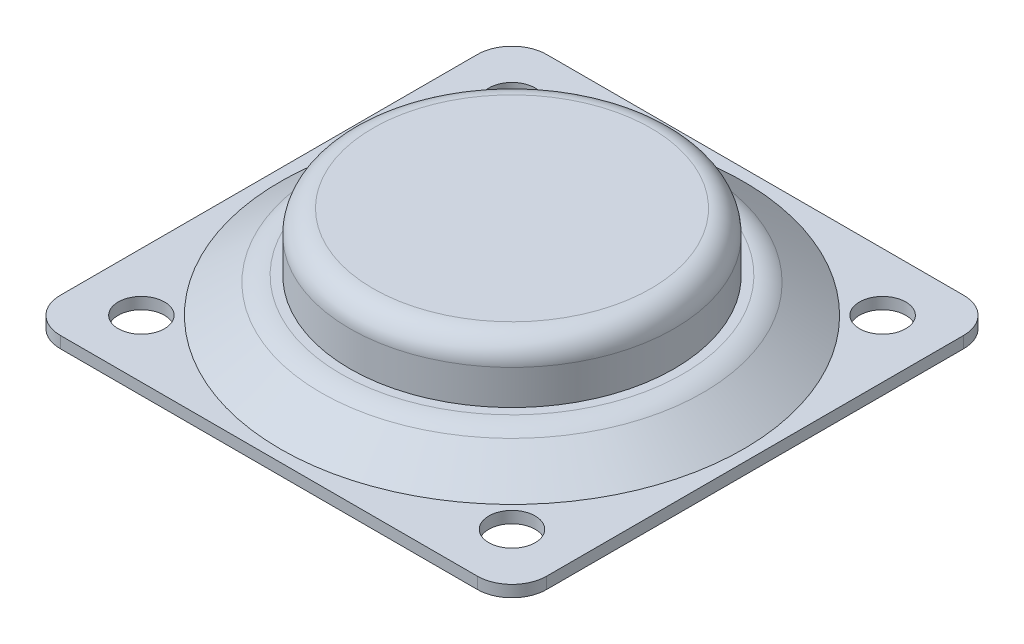
ISO-10303-21;
HEADER;
FILE_DESCRIPTION(('STEP AP214'),'2;1');
FILE_NAME('part.step','',(''),(''),'','','');
FILE_SCHEMA(('AUTOMOTIVE_DESIGN { 1 0 10303 214 1 1 1 1 }'));
ENDSEC;
DATA;
#1=APPLICATION_CONTEXT('core data for automotive mechanical design processes');
#2=APPLICATION_PROTOCOL_DEFINITION('international standard','automotive_design',2000,#1);
#3=PRODUCT_CONTEXT('',#1,'mechanical');
#4=PRODUCT('Part','Part','',(#3));
#5=PRODUCT_RELATED_PRODUCT_CATEGORY('part','',(#4));
#6=PRODUCT_DEFINITION_FORMATION('','',#4);
#7=PRODUCT_DEFINITION_CONTEXT('part definition',#1,'design');
#8=PRODUCT_DEFINITION('design','',#6,#7);
#9=PRODUCT_DEFINITION_SHAPE('','',#8);
#10=(LENGTH_UNIT() NAMED_UNIT(*) SI_UNIT(.MILLI.,.METRE.));
#11=(NAMED_UNIT(*) PLANE_ANGLE_UNIT() SI_UNIT($,.RADIAN.));
#12=(NAMED_UNIT(*) SI_UNIT($,.STERADIAN.) SOLID_ANGLE_UNIT());
#13=UNCERTAINTY_MEASURE_WITH_UNIT(LENGTH_MEASURE(1.E-05),#10,'distance_accuracy_value','');
#14=(GEOMETRIC_REPRESENTATION_CONTEXT(3) GLOBAL_UNCERTAINTY_ASSIGNED_CONTEXT((#13)) GLOBAL_UNIT_ASSIGNED_CONTEXT((#10,
#11,#12)) REPRESENTATION_CONTEXT('',''));
#15=CARTESIAN_POINT('',(0.,0.,0.));
#16=DIRECTION('',(0.,0.,1.));
#17=DIRECTION('',(1.,0.,0.));
#18=AXIS2_PLACEMENT_3D('',#15,#16,#17);
#19=CARTESIAN_POINT('',(-21.,1.,21.));
#20=DIRECTION('',(1.,0.,0.));
#21=DIRECTION('',(0.,0.,-1.));
#22=AXIS2_PLACEMENT_3D('',#19,#20,#21);
#23=PLANE('',#22);
#24=DIRECTION('',(0.,0.,1.));
#25=VECTOR('',#24,1.);
#26=CARTESIAN_POINT('',(-21.,1.,21.));
#27=LINE('',#26,#25);
#28=CARTESIAN_POINT('',(-21.,1.,-18.));
#29=VERTEX_POINT('',#28);
#30=CARTESIAN_POINT('',(-21.,1.,18.));
#31=VERTEX_POINT('',#30);
#32=EDGE_CURVE('E134',#29,#31,#27,.T.);
#33=ORIENTED_EDGE('',*,*,#32,.F.);
#34=DIRECTION('',(0.,-1.,0.));
#35=VECTOR('',#34,1.);
#36=CARTESIAN_POINT('',(-21.,1.,-18.));
#37=LINE('',#36,#35);
#38=CARTESIAN_POINT('',(-21.,0.,-18.));
#39=VERTEX_POINT('',#38);
#40=EDGE_CURVE('E119',#29,#39,#37,.T.);
#41=ORIENTED_EDGE('',*,*,#40,.T.);
#42=DIRECTION('',(0.,0.,1.));
#43=VECTOR('',#42,1.);
#44=CARTESIAN_POINT('',(-21.,0.,21.));
#45=LINE('',#44,#43);
#46=CARTESIAN_POINT('',(-21.,0.,18.));
#47=VERTEX_POINT('',#46);
#48=EDGE_CURVE('E131',#39,#47,#45,.T.);
#49=ORIENTED_EDGE('',*,*,#48,.T.);
#50=DIRECTION('',(0.,-1.,0.));
#51=VECTOR('',#50,1.);
#52=CARTESIAN_POINT('',(-21.,1.,18.));
#53=LINE('',#52,#51);
#54=EDGE_CURVE('E136',#47,#31,#53,.F.);
#55=ORIENTED_EDGE('',*,*,#54,.T.);
#56=EDGE_LOOP('',(#33,#41,#49,#55));
#57=FACE_BOUND('',#56,.T.);
#58=ADVANCED_FACE('F47',(#57),#23,.F.);
#59=CARTESIAN_POINT('',(-21.,1.,21.));
#60=DIRECTION('',(0.,0.,-1.));
#61=DIRECTION('',(-1.,0.,0.));
#62=AXIS2_PLACEMENT_3D('',#59,#60,#61);
#63=PLANE('',#62);
#64=DIRECTION('',(1.,0.,0.));
#65=VECTOR('',#64,1.);
#66=CARTESIAN_POINT('',(-21.,0.,21.));
#67=LINE('',#66,#65);
#68=CARTESIAN_POINT('',(-18.,0.,21.));
#69=VERTEX_POINT('',#68);
#70=CARTESIAN_POINT('',(18.,0.,21.));
#71=VERTEX_POINT('',#70);
#72=EDGE_CURVE('E140',#69,#71,#67,.T.);
#73=ORIENTED_EDGE('',*,*,#72,.T.);
#74=DIRECTION('',(0.,-1.,0.));
#75=VECTOR('',#74,1.);
#76=CARTESIAN_POINT('',(18.,1.,21.));
#77=LINE('',#76,#75);
#78=CARTESIAN_POINT('',(18.,1.,21.));
#79=VERTEX_POINT('',#78);
#80=EDGE_CURVE('E51',#71,#79,#77,.F.);
#81=ORIENTED_EDGE('',*,*,#80,.T.);
#82=DIRECTION('',(1.,0.,0.));
#83=VECTOR('',#82,1.);
#84=CARTESIAN_POINT('',(-21.,1.,21.));
#85=LINE('',#84,#83);
#86=CARTESIAN_POINT('',(-18.,1.,21.));
#87=VERTEX_POINT('',#86);
#88=EDGE_CURVE('E181',#87,#79,#85,.T.);
#89=ORIENTED_EDGE('',*,*,#88,.F.);
#90=DIRECTION('',(0.,-1.,0.));
#91=VECTOR('',#90,1.);
#92=CARTESIAN_POINT('',(-18.,1.,21.));
#93=LINE('',#92,#91);
#94=EDGE_CURVE('E174',#87,#69,#93,.T.);
#95=ORIENTED_EDGE('',*,*,#94,.T.);
#96=EDGE_LOOP('',(#73,#81,#89,#95));
#97=FACE_BOUND('',#96,.T.);
#98=ADVANCED_FACE('F180',(#97),#63,.F.);
#99=CARTESIAN_POINT('',(21.,1.,21.));
#100=DIRECTION('',(-1.,0.,0.));
#101=DIRECTION('',(0.,0.,1.));
#102=AXIS2_PLACEMENT_3D('',#99,#100,#101);
#103=PLANE('',#102);
#104=DIRECTION('',(0.,0.,-1.));
#105=VECTOR('',#104,1.);
#106=CARTESIAN_POINT('',(21.,0.,21.));
#107=LINE('',#106,#105);
#108=CARTESIAN_POINT('',(21.,0.,18.));
#109=VERTEX_POINT('',#108);
#110=CARTESIAN_POINT('',(21.,0.,-18.));
#111=VERTEX_POINT('',#110);
#112=EDGE_CURVE('E144',#109,#111,#107,.T.);
#113=ORIENTED_EDGE('',*,*,#112,.T.);
#114=DIRECTION('',(0.,-1.,0.));
#115=VECTOR('',#114,1.);
#116=CARTESIAN_POINT('',(21.,1.,-18.));
#117=LINE('',#116,#115);
#118=CARTESIAN_POINT('',(21.,1.,-18.));
#119=VERTEX_POINT('',#118);
#120=EDGE_CURVE('E63',#111,#119,#117,.F.);
#121=ORIENTED_EDGE('',*,*,#120,.T.);
#122=DIRECTION('',(0.,0.,-1.));
#123=VECTOR('',#122,1.);
#124=CARTESIAN_POINT('',(21.,1.,21.));
#125=LINE('',#124,#123);
#126=CARTESIAN_POINT('',(21.,1.,18.));
#127=VERTEX_POINT('',#126);
#128=EDGE_CURVE('E186',#127,#119,#125,.T.);
#129=ORIENTED_EDGE('',*,*,#128,.F.);
#130=DIRECTION('',(0.,-1.,0.));
#131=VECTOR('',#130,1.);
#132=CARTESIAN_POINT('',(21.,1.,18.));
#133=LINE('',#132,#131);
#134=EDGE_CURVE('E171',#127,#109,#133,.T.);
#135=ORIENTED_EDGE('',*,*,#134,.T.);
#136=EDGE_LOOP('',(#113,#121,#129,#135));
#137=FACE_BOUND('',#136,.T.);
#138=ADVANCED_FACE('F191',(#137),#103,.F.);
#139=CARTESIAN_POINT('',(-21.,1.,-21.));
#140=DIRECTION('',(0.,0.,1.));
#141=DIRECTION('',(1.,0.,0.));
#142=AXIS2_PLACEMENT_3D('',#139,#140,#141);
#143=PLANE('',#142);
#144=DIRECTION('',(-1.,0.,0.));
#145=VECTOR('',#144,1.);
#146=CARTESIAN_POINT('',(-21.,0.,-21.));
#147=LINE('',#146,#145);
#148=CARTESIAN_POINT('',(18.,0.,-21.));
#149=VERTEX_POINT('',#148);
#150=CARTESIAN_POINT('',(-18.,0.,-21.));
#151=VERTEX_POINT('',#150);
#152=EDGE_CURVE('E154',#149,#151,#147,.T.);
#153=ORIENTED_EDGE('',*,*,#152,.T.);
#154=DIRECTION('',(0.,-1.,0.));
#155=VECTOR('',#154,1.);
#156=CARTESIAN_POINT('',(-18.,1.,-21.));
#157=LINE('',#156,#155);
#158=CARTESIAN_POINT('',(-18.,1.,-21.));
#159=VERTEX_POINT('',#158);
#160=EDGE_CURVE('E120',#151,#159,#157,.F.);
#161=ORIENTED_EDGE('',*,*,#160,.T.);
#162=DIRECTION('',(-1.,0.,0.));
#163=VECTOR('',#162,1.);
#164=CARTESIAN_POINT('',(-21.,1.,-21.));
#165=LINE('',#164,#163);
#166=CARTESIAN_POINT('',(18.,1.,-21.));
#167=VERTEX_POINT('',#166);
#168=EDGE_CURVE('E150',#167,#159,#165,.T.);
#169=ORIENTED_EDGE('',*,*,#168,.F.);
#170=DIRECTION('',(0.,-1.,0.));
#171=VECTOR('',#170,1.);
#172=CARTESIAN_POINT('',(18.,1.,-21.));
#173=LINE('',#172,#171);
#174=EDGE_CURVE('E125',#167,#149,#173,.T.);
#175=ORIENTED_EDGE('',*,*,#174,.T.);
#176=EDGE_LOOP('',(#153,#161,#169,#175));
#177=FACE_BOUND('',#176,.T.);
#178=ADVANCED_FACE('F198',(#177),#143,.F.);
#179=CARTESIAN_POINT('',(0.,1.,0.));
#180=DIRECTION('',(0.,-1.,0.));
#181=DIRECTION('',(0.,0.,-1.));
#182=AXIS2_PLACEMENT_3D('',#179,#180,#181);
#183=PLANE('',#182);
#184=CARTESIAN_POINT('',(16.,1.,16.));
#185=DIRECTION('',(0.,-1.,0.));
#186=DIRECTION('',(0.,0.,-1.));
#187=AXIS2_PLACEMENT_3D('',#184,#185,#186);
#188=CIRCLE('',#187,2.);
#189=CARTESIAN_POINT('',(16.,1.,14.));
#190=VERTEX_POINT('',#189);
#191=EDGE_CURVE('E218',#190,#190,#188,.F.);
#192=ORIENTED_EDGE('',*,*,#191,.F.);
#193=EDGE_LOOP('',(#192));
#194=FACE_BOUND('',#193,.T.);
#195=CARTESIAN_POINT('',(-16.,1.,-16.));
#196=DIRECTION('',(0.,-1.,0.));
#197=DIRECTION('',(0.,0.,-1.));
#198=AXIS2_PLACEMENT_3D('',#195,#196,#197);
#199=CIRCLE('',#198,2.);
#200=CARTESIAN_POINT('',(-16.,1.,-18.));
#201=VERTEX_POINT('',#200);
#202=EDGE_CURVE('E219',#201,#201,#199,.F.);
#203=ORIENTED_EDGE('',*,*,#202,.F.);
#204=EDGE_LOOP('',(#203));
#205=FACE_BOUND('',#204,.T.);
#206=CARTESIAN_POINT('',(16.,1.,-16.));
#207=DIRECTION('',(0.,-1.,0.));
#208=DIRECTION('',(0.,0.,-1.));
#209=AXIS2_PLACEMENT_3D('',#206,#207,#208);
#210=CIRCLE('',#209,2.);
#211=CARTESIAN_POINT('',(16.,1.,-18.));
#212=VERTEX_POINT('',#211);
#213=EDGE_CURVE('E226',#212,#212,#210,.F.);
#214=ORIENTED_EDGE('',*,*,#213,.F.);
#215=EDGE_LOOP('',(#214));
#216=FACE_BOUND('',#215,.T.);
#217=CARTESIAN_POINT('',(-16.,1.,16.));
#218=DIRECTION('',(0.,-1.,0.));
#219=DIRECTION('',(0.,0.,-1.));
#220=AXIS2_PLACEMENT_3D('',#217,#218,#219);
#221=CIRCLE('',#220,2.);
#222=CARTESIAN_POINT('',(-16.,1.,14.));
#223=VERTEX_POINT('',#222);
#224=EDGE_CURVE('E212',#223,#223,#221,.F.);
#225=ORIENTED_EDGE('',*,*,#224,.F.);
#226=EDGE_LOOP('',(#225));
#227=FACE_BOUND('',#226,.T.);
#228=CARTESIAN_POINT('',(0.,0.999999999999952,0.));
#229=DIRECTION('',(0.,1.,0.));
#230=DIRECTION('',(0.,0.,1.));
#231=AXIS2_PLACEMENT_3D('',#228,#229,#230);
#232=CIRCLE('',#231,20.);
#233=CARTESIAN_POINT('',(0.,1.,20.));
#234=VERTEX_POINT('',#233);
#235=EDGE_CURVE('E13',#234,#234,#232,.T.);
#236=ORIENTED_EDGE('',*,*,#235,.F.);
#237=EDGE_LOOP('',(#236));
#238=FACE_BOUND('',#237,.T.);
#239=ORIENTED_EDGE('',*,*,#168,.T.);
#240=CARTESIAN_POINT('',(-18.,1.,-18.));
#241=DIRECTION('',(0.,-1.,0.));
#242=DIRECTION('',(0.,0.,-1.));
#243=AXIS2_PLACEMENT_3D('',#240,#241,#242);
#244=CIRCLE('',#243,3.);
#245=EDGE_CURVE('E169',#159,#29,#244,.F.);
#246=ORIENTED_EDGE('',*,*,#245,.T.);
#247=ORIENTED_EDGE('',*,*,#32,.T.);
#248=CARTESIAN_POINT('',(-18.,1.,18.));
#249=DIRECTION('',(0.,-1.,0.));
#250=DIRECTION('',(0.,0.,-1.));
#251=AXIS2_PLACEMENT_3D('',#248,#249,#250);
#252=CIRCLE('',#251,3.);
#253=EDGE_CURVE('E164',#31,#87,#252,.F.);
#254=ORIENTED_EDGE('',*,*,#253,.T.);
#255=ORIENTED_EDGE('',*,*,#88,.T.);
#256=CARTESIAN_POINT('',(18.,1.,18.));
#257=DIRECTION('',(0.,-1.,0.));
#258=DIRECTION('',(0.,0.,-1.));
#259=AXIS2_PLACEMENT_3D('',#256,#257,#258);
#260=CIRCLE('',#259,3.);
#261=EDGE_CURVE('E70',#79,#127,#260,.F.);
#262=ORIENTED_EDGE('',*,*,#261,.T.);
#263=ORIENTED_EDGE('',*,*,#128,.T.);
#264=CARTESIAN_POINT('',(18.,1.,-18.));
#265=DIRECTION('',(0.,-1.,0.));
#266=DIRECTION('',(0.,0.,-1.));
#267=AXIS2_PLACEMENT_3D('',#264,#265,#266);
#268=CIRCLE('',#267,3.);
#269=EDGE_CURVE('E167',#119,#167,#268,.F.);
#270=ORIENTED_EDGE('',*,*,#269,.T.);
#271=EDGE_LOOP('',(#239,#246,#247,#254,#255,#262,#263,#270));
#272=FACE_BOUND('',#271,.T.);
#273=ADVANCED_FACE('F184',(#194,#205,#216,#227,#238,#272),#183,.F.);
#274=CARTESIAN_POINT('',(0.,0.,0.));
#275=DIRECTION('',(0.,-1.,0.));
#276=DIRECTION('',(0.,0.,-1.));
#277=AXIS2_PLACEMENT_3D('',#274,#275,#276);
#278=PLANE('',#277);
#279=CARTESIAN_POINT('',(16.,0.,16.));
#280=DIRECTION('',(0.,-1.,0.));
#281=DIRECTION('',(0.,0.,1.));
#282=AXIS2_PLACEMENT_3D('',#279,#280,#281);
#283=CIRCLE('',#282,2.);
#284=CARTESIAN_POINT('',(16.,0.,18.));
#285=VERTEX_POINT('',#284);
#286=EDGE_CURVE('E222',#285,#285,#283,.T.);
#287=ORIENTED_EDGE('',*,*,#286,.F.);
#288=EDGE_LOOP('',(#287));
#289=FACE_BOUND('',#288,.T.);
#290=CARTESIAN_POINT('',(-16.,0.,-16.));
#291=DIRECTION('',(0.,-1.,0.));
#292=DIRECTION('',(0.,0.,1.));
#293=AXIS2_PLACEMENT_3D('',#290,#291,#292);
#294=CIRCLE('',#293,2.);
#295=CARTESIAN_POINT('',(-16.,0.,-14.));
#296=VERTEX_POINT('',#295);
#297=EDGE_CURVE('E223',#296,#296,#294,.T.);
#298=ORIENTED_EDGE('',*,*,#297,.F.);
#299=EDGE_LOOP('',(#298));
#300=FACE_BOUND('',#299,.T.);
#301=CARTESIAN_POINT('',(16.,0.,-16.));
#302=DIRECTION('',(0.,-1.,0.));
#303=DIRECTION('',(0.,0.,-1.));
#304=AXIS2_PLACEMENT_3D('',#301,#302,#303);
#305=CIRCLE('',#304,2.);
#306=CARTESIAN_POINT('',(16.,0.,-18.));
#307=VERTEX_POINT('',#306);
#308=EDGE_CURVE('E233',#307,#307,#305,.T.);
#309=ORIENTED_EDGE('',*,*,#308,.F.);
#310=EDGE_LOOP('',(#309));
#311=FACE_BOUND('',#310,.T.);
#312=CARTESIAN_POINT('',(-16.,0.,16.));
#313=DIRECTION('',(0.,-1.,0.));
#314=DIRECTION('',(0.,0.,-1.));
#315=AXIS2_PLACEMENT_3D('',#312,#313,#314);
#316=CIRCLE('',#315,2.);
#317=CARTESIAN_POINT('',(-16.,0.,14.));
#318=VERTEX_POINT('',#317);
#319=EDGE_CURVE('E215',#318,#318,#316,.T.);
#320=ORIENTED_EDGE('',*,*,#319,.F.);
#321=EDGE_LOOP('',(#320));
#322=FACE_BOUND('',#321,.T.);
#323=ORIENTED_EDGE('',*,*,#48,.F.);
#324=CARTESIAN_POINT('',(-18.,0.,-18.));
#325=DIRECTION('',(0.,-1.,0.));
#326=DIRECTION('',(0.,0.,-1.));
#327=AXIS2_PLACEMENT_3D('',#324,#325,#326);
#328=CIRCLE('',#327,3.);
#329=EDGE_CURVE('E115',#39,#151,#328,.T.);
#330=ORIENTED_EDGE('',*,*,#329,.T.);
#331=ORIENTED_EDGE('',*,*,#152,.F.);
#332=CARTESIAN_POINT('',(18.,0.,-18.));
#333=DIRECTION('',(0.,-1.,0.));
#334=DIRECTION('',(0.,0.,-1.));
#335=AXIS2_PLACEMENT_3D('',#332,#333,#334);
#336=CIRCLE('',#335,3.);
#337=EDGE_CURVE('E126',#149,#111,#336,.T.);
#338=ORIENTED_EDGE('',*,*,#337,.T.);
#339=ORIENTED_EDGE('',*,*,#112,.F.);
#340=CARTESIAN_POINT('',(18.,0.,18.));
#341=DIRECTION('',(0.,-1.,0.));
#342=DIRECTION('',(0.,0.,-1.));
#343=AXIS2_PLACEMENT_3D('',#340,#341,#342);
#344=CIRCLE('',#343,3.);
#345=EDGE_CURVE('E158',#109,#71,#344,.T.);
#346=ORIENTED_EDGE('',*,*,#345,.T.);
#347=ORIENTED_EDGE('',*,*,#72,.F.);
#348=CARTESIAN_POINT('',(-18.,0.,18.));
#349=DIRECTION('',(0.,-1.,0.));
#350=DIRECTION('',(0.,0.,-1.));
#351=AXIS2_PLACEMENT_3D('',#348,#349,#350);
#352=CIRCLE('',#351,3.);
#353=EDGE_CURVE('E135',#69,#47,#352,.T.);
#354=ORIENTED_EDGE('',*,*,#353,.T.);
#355=EDGE_LOOP('',(#323,#330,#331,#338,#339,#346,#347,#354));
#356=FACE_BOUND('',#355,.T.);
#357=ADVANCED_FACE('F138',(#289,#300,#311,#322,#356),#278,.T.);
#358=CARTESIAN_POINT('',(-18.,1.,-18.));
#359=DIRECTION('',(0.,-1.,0.));
#360=DIRECTION('',(0.,0.,-1.));
#361=AXIS2_PLACEMENT_3D('',#358,#359,#360);
#362=CYLINDRICAL_SURFACE('',#361,3.);
#363=ORIENTED_EDGE('',*,*,#245,.F.);
#364=ORIENTED_EDGE('',*,*,#160,.F.);
#365=ORIENTED_EDGE('',*,*,#329,.F.);
#366=ORIENTED_EDGE('',*,*,#40,.F.);
#367=EDGE_LOOP('',(#363,#364,#365,#366));
#368=FACE_BOUND('',#367,.T.);
#369=ADVANCED_FACE('F118',(#368),#362,.T.);
#370=CARTESIAN_POINT('',(18.,1.,-18.));
#371=DIRECTION('',(0.,-1.,0.));
#372=DIRECTION('',(0.,0.,-1.));
#373=AXIS2_PLACEMENT_3D('',#370,#371,#372);
#374=CYLINDRICAL_SURFACE('',#373,3.);
#375=ORIENTED_EDGE('',*,*,#269,.F.);
#376=ORIENTED_EDGE('',*,*,#120,.F.);
#377=ORIENTED_EDGE('',*,*,#337,.F.);
#378=ORIENTED_EDGE('',*,*,#174,.F.);
#379=EDGE_LOOP('',(#375,#376,#377,#378));
#380=FACE_BOUND('',#379,.T.);
#381=ADVANCED_FACE('F195',(#380),#374,.T.);
#382=CARTESIAN_POINT('',(18.,1.,18.));
#383=DIRECTION('',(0.,-1.,0.));
#384=DIRECTION('',(0.,0.,-1.));
#385=AXIS2_PLACEMENT_3D('',#382,#383,#384);
#386=CYLINDRICAL_SURFACE('',#385,3.);
#387=ORIENTED_EDGE('',*,*,#261,.F.);
#388=ORIENTED_EDGE('',*,*,#80,.F.);
#389=ORIENTED_EDGE('',*,*,#345,.F.);
#390=ORIENTED_EDGE('',*,*,#134,.F.);
#391=EDGE_LOOP('',(#387,#388,#389,#390));
#392=FACE_BOUND('',#391,.T.);
#393=ADVANCED_FACE('F189',(#392),#386,.T.);
#394=CARTESIAN_POINT('',(-18.,1.,18.));
#395=DIRECTION('',(0.,-1.,0.));
#396=DIRECTION('',(0.,0.,-1.));
#397=AXIS2_PLACEMENT_3D('',#394,#395,#396);
#398=CYLINDRICAL_SURFACE('',#397,3.);
#399=ORIENTED_EDGE('',*,*,#253,.F.);
#400=ORIENTED_EDGE('',*,*,#54,.F.);
#401=ORIENTED_EDGE('',*,*,#353,.F.);
#402=ORIENTED_EDGE('',*,*,#94,.F.);
#403=EDGE_LOOP('',(#399,#400,#401,#402));
#404=FACE_BOUND('',#403,.T.);
#405=ADVANCED_FACE('F49',(#404),#398,.T.);
#406=CARTESIAN_POINT('',(0.,3.45745613286695,0.));
#407=DIRECTION('',(0.,-1.,0.));
#408=DIRECTION('',(0.,0.,-1.));
#409=AXIS2_PLACEMENT_3D('',#406,#407,#408);
#410=CONICAL_SURFACE('',#409,16.4903889221898,0.959931088596882);
#411=ORIENTED_EDGE('',*,*,#235,.T.);
#412=EDGE_LOOP('',(#411));
#413=FACE_BOUND('',#412,.T.);
#414=CARTESIAN_POINT('',(0.,3.45745613286695,0.));
#415=DIRECTION('',(0.,1.,0.));
#416=DIRECTION('',(0.,0.,1.));
#417=AXIS2_PLACEMENT_3D('',#414,#415,#416);
#418=CIRCLE('',#417,16.4903889221898);
#419=CARTESIAN_POINT('',(0.,3.45745613286699,16.4903889221898));
#420=VERTEX_POINT('',#419);
#421=EDGE_CURVE('E141',#420,#420,#418,.T.);
#422=ORIENTED_EDGE('',*,*,#421,.F.);
#423=EDGE_LOOP('',(#422));
#424=FACE_BOUND('',#423,.T.);
#425=ADVANCED_FACE('F259',(#413,#424),#410,.T.);
#426=CARTESIAN_POINT('',(0.,0.999999999999965,0.));
#427=DIRECTION('',(0.,1.,0.));
#428=DIRECTION('',(0.,0.,1.));
#429=AXIS2_PLACEMENT_3D('',#426,#427,#428);
#430=TOROIDAL_SURFACE('',#429,14.7696596131367,3.);
#431=ORIENTED_EDGE('',*,*,#421,.T.);
#432=EDGE_LOOP('',(#431));
#433=FACE_BOUND('',#432,.T.);
#434=CARTESIAN_POINT('',(0.,3.99999999999997,0.));
#435=DIRECTION('',(0.,1.,0.));
#436=DIRECTION('',(0.,0.,1.));
#437=AXIS2_PLACEMENT_3D('',#434,#435,#436);
#438=CIRCLE('',#437,14.7696596131367);
#439=CARTESIAN_POINT('',(0.,4.,14.7696596131367));
#440=VERTEX_POINT('',#439);
#441=EDGE_CURVE('E147',#440,#440,#438,.T.);
#442=ORIENTED_EDGE('',*,*,#441,.F.);
#443=EDGE_LOOP('',(#442));
#444=FACE_BOUND('',#443,.T.);
#445=ADVANCED_FACE('F262',(#433,#444),#430,.T.);
#446=CARTESIAN_POINT('',(0.,4.,14.7696596131367));
#447=DIRECTION('',(0.,1.,0.));
#448=DIRECTION('',(0.,0.,1.));
#449=AXIS2_PLACEMENT_3D('',#446,#447,#448);
#450=PLANE('',#449);
#451=ORIENTED_EDGE('',*,*,#441,.T.);
#452=EDGE_LOOP('',(#451));
#453=FACE_BOUND('',#452,.T.);
#454=CARTESIAN_POINT('',(0.,3.99999999999997,0.));
#455=DIRECTION('',(0.,1.,0.));
#456=DIRECTION('',(0.,0.,1.));
#457=AXIS2_PLACEMENT_3D('',#454,#455,#456);
#458=CIRCLE('',#457,14.);
#459=CARTESIAN_POINT('',(0.,4.,14.));
#460=VERTEX_POINT('',#459);
#461=EDGE_CURVE('E203',#460,#460,#458,.T.);
#462=ORIENTED_EDGE('',*,*,#461,.F.);
#463=EDGE_LOOP('',(#462));
#464=FACE_BOUND('',#463,.T.);
#465=ADVANCED_FACE('F268',(#453,#464),#450,.T.);
#466=CARTESIAN_POINT('',(0.,4.,0.));
#467=DIRECTION('',(0.,1.,0.));
#468=DIRECTION('',(0.,0.,1.));
#469=AXIS2_PLACEMENT_3D('',#466,#467,#468);
#470=CYLINDRICAL_SURFACE('',#469,14.);
#471=ORIENTED_EDGE('',*,*,#461,.T.);
#472=EDGE_LOOP('',(#471));
#473=FACE_BOUND('',#472,.T.);
#474=CARTESIAN_POINT('',(0.,6.99999999999997,0.));
#475=DIRECTION('',(0.,1.,0.));
#476=DIRECTION('',(0.,0.,1.));
#477=AXIS2_PLACEMENT_3D('',#474,#475,#476);
#478=CIRCLE('',#477,14.);
#479=CARTESIAN_POINT('',(0.,7.,14.));
#480=VERTEX_POINT('',#479);
#481=EDGE_CURVE('E206',#480,#480,#478,.T.);
#482=ORIENTED_EDGE('',*,*,#481,.F.);
#483=EDGE_LOOP('',(#482));
#484=FACE_BOUND('',#483,.T.);
#485=ADVANCED_FACE('F274',(#473,#484),#470,.T.);
#486=CARTESIAN_POINT('',(0.,6.99999999999997,0.));
#487=DIRECTION('',(0.,1.,0.));
#488=DIRECTION('',(0.,0.,1.));
#489=AXIS2_PLACEMENT_3D('',#486,#487,#488);
#490=TOROIDAL_SURFACE('',#489,12.,2.);
#491=ORIENTED_EDGE('',*,*,#481,.T.);
#492=EDGE_LOOP('',(#491));
#493=FACE_BOUND('',#492,.T.);
#494=CARTESIAN_POINT('',(0.,8.99999999999997,0.));
#495=DIRECTION('',(0.,1.,0.));
#496=DIRECTION('',(0.,0.,1.));
#497=AXIS2_PLACEMENT_3D('',#494,#495,#496);
#498=CIRCLE('',#497,12.);
#499=CARTESIAN_POINT('',(0.,9.,12.));
#500=VERTEX_POINT('',#499);
#501=EDGE_CURVE('E209',#500,#500,#498,.T.);
#502=ORIENTED_EDGE('',*,*,#501,.F.);
#503=EDGE_LOOP('',(#502));
#504=FACE_BOUND('',#503,.T.);
#505=ADVANCED_FACE('F280',(#493,#504),#490,.T.);
#506=CARTESIAN_POINT('',(0.,9.00000000000001,12.));
#507=DIRECTION('',(0.,1.,0.));
#508=DIRECTION('',(0.,0.,1.));
#509=AXIS2_PLACEMENT_3D('',#506,#507,#508);
#510=PLANE('',#509);
#511=ORIENTED_EDGE('',*,*,#501,.T.);
#512=EDGE_LOOP('',(#511));
#513=FACE_BOUND('',#512,.T.);
#514=ADVANCED_FACE('F249',(#513),#510,.T.);
#515=CARTESIAN_POINT('',(-16.,9.001,16.));
#516=DIRECTION('',(0.,-1.,0.));
#517=DIRECTION('',(0.,0.,-1.));
#518=AXIS2_PLACEMENT_3D('',#515,#516,#517);
#519=CYLINDRICAL_SURFACE('',#518,2.);
#520=ORIENTED_EDGE('',*,*,#319,.T.);
#521=EDGE_LOOP('',(#520));
#522=FACE_BOUND('',#521,.T.);
#523=ORIENTED_EDGE('',*,*,#224,.T.);
#524=EDGE_LOOP('',(#523));
#525=FACE_BOUND('',#524,.T.);
#526=ADVANCED_FACE('F246',(#522,#525),#519,.F.);
#527=CARTESIAN_POINT('',(16.,9.001,-16.));
#528=DIRECTION('',(0.,-1.,0.));
#529=DIRECTION('',(0.,0.,-1.));
#530=AXIS2_PLACEMENT_3D('',#527,#528,#529);
#531=CYLINDRICAL_SURFACE('',#530,2.);
#532=ORIENTED_EDGE('',*,*,#308,.T.);
#533=EDGE_LOOP('',(#532));
#534=FACE_BOUND('',#533,.T.);
#535=ORIENTED_EDGE('',*,*,#213,.T.);
#536=EDGE_LOOP('',(#535));
#537=FACE_BOUND('',#536,.T.);
#538=ADVANCED_FACE('F237',(#534,#537),#531,.F.);
#539=CARTESIAN_POINT('',(-16.,9.001,-16.));
#540=DIRECTION('',(0.,-1.,0.));
#541=DIRECTION('',(0.,0.,-1.));
#542=AXIS2_PLACEMENT_3D('',#539,#540,#541);
#543=CYLINDRICAL_SURFACE('',#542,2.);
#544=ORIENTED_EDGE('',*,*,#297,.T.);
#545=EDGE_LOOP('',(#544));
#546=FACE_BOUND('',#545,.T.);
#547=ORIENTED_EDGE('',*,*,#202,.T.);
#548=EDGE_LOOP('',(#547));
#549=FACE_BOUND('',#548,.T.);
#550=ADVANCED_FACE('F365',(#546,#549),#543,.F.);
#551=CARTESIAN_POINT('',(16.,9.001,16.));
#552=DIRECTION('',(0.,-1.,0.));
#553=DIRECTION('',(0.,0.,-1.));
#554=AXIS2_PLACEMENT_3D('',#551,#552,#553);
#555=CYLINDRICAL_SURFACE('',#554,2.);
#556=ORIENTED_EDGE('',*,*,#286,.T.);
#557=EDGE_LOOP('',(#556));
#558=FACE_BOUND('',#557,.T.);
#559=ORIENTED_EDGE('',*,*,#191,.T.);
#560=EDGE_LOOP('',(#559));
#561=FACE_BOUND('',#560,.T.);
#562=ADVANCED_FACE('F374',(#558,#561),#555,.F.);
#563=CLOSED_SHELL('',(#58,#98,#138,#178,#273,#357,#369,#381,#393,#405,#425,#445,#465,#485,#505,
#514,#526,#538,#550,#562));
#564=MANIFOLD_SOLID_BREP('B2',#563);
#565=ADVANCED_BREP_SHAPE_REPRESENTATION('',(#18,#564),#14);
#566=SHAPE_DEFINITION_REPRESENTATION(#9,#565);
ENDSEC;
END-ISO-10303-21;
